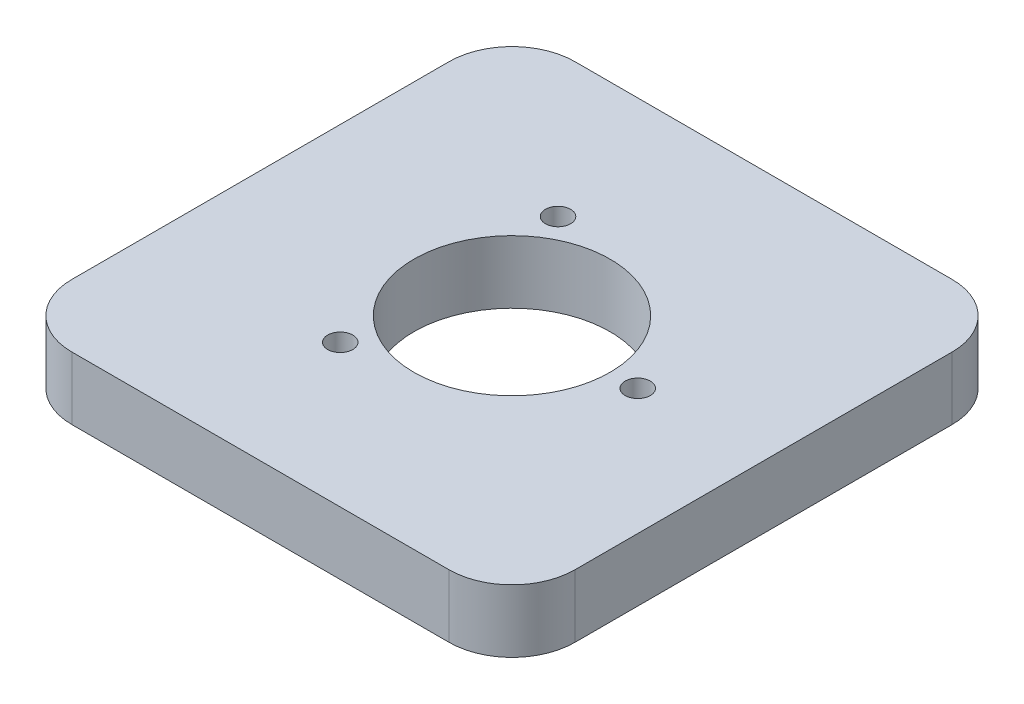
ISO-10303-21;
HEADER;
FILE_DESCRIPTION(('STEP AP214'),'2;1');
FILE_NAME('part.step','',(''),(''),'','','');
FILE_SCHEMA(('AUTOMOTIVE_DESIGN { 1 0 10303 214 1 1 1 1 }'));
ENDSEC;
DATA;
#1=APPLICATION_CONTEXT('core data for automotive mechanical design processes');
#2=APPLICATION_PROTOCOL_DEFINITION('international standard','automotive_design',2000,#1);
#3=PRODUCT_CONTEXT('',#1,'mechanical');
#4=PRODUCT('Part','Part','',(#3));
#5=PRODUCT_RELATED_PRODUCT_CATEGORY('part','',(#4));
#6=PRODUCT_DEFINITION_FORMATION('','',#4);
#7=PRODUCT_DEFINITION_CONTEXT('part definition',#1,'design');
#8=PRODUCT_DEFINITION('design','',#6,#7);
#9=PRODUCT_DEFINITION_SHAPE('','',#8);
#10=(LENGTH_UNIT() NAMED_UNIT(*) SI_UNIT(.MILLI.,.METRE.));
#11=(NAMED_UNIT(*) PLANE_ANGLE_UNIT() SI_UNIT($,.RADIAN.));
#12=(NAMED_UNIT(*) SI_UNIT($,.STERADIAN.) SOLID_ANGLE_UNIT());
#13=UNCERTAINTY_MEASURE_WITH_UNIT(LENGTH_MEASURE(1.E-05),#10,'distance_accuracy_value','');
#14=(GEOMETRIC_REPRESENTATION_CONTEXT(3) GLOBAL_UNCERTAINTY_ASSIGNED_CONTEXT((#13)) GLOBAL_UNIT_ASSIGNED_CONTEXT((#10,
#11,#12)) REPRESENTATION_CONTEXT('',''));
#15=CARTESIAN_POINT('',(0.,0.,0.));
#16=DIRECTION('',(0.,0.,1.));
#17=DIRECTION('',(1.,0.,0.));
#18=AXIS2_PLACEMENT_3D('',#15,#16,#17);
#19=CARTESIAN_POINT('',(25.4,6.35,25.4));
#20=DIRECTION('',(-1.,0.,0.));
#21=DIRECTION('',(0.,0.,1.));
#22=AXIS2_PLACEMENT_3D('',#19,#20,#21);
#23=PLANE('',#22);
#24=DIRECTION('',(0.,0.,-1.));
#25=VECTOR('',#24,1.);
#26=CARTESIAN_POINT('',(25.4,6.35,25.4));
#27=LINE('',#26,#25);
#28=CARTESIAN_POINT('',(25.4,6.35,19.05));
#29=VERTEX_POINT('',#28);
#30=CARTESIAN_POINT('',(25.4,6.35,-19.05));
#31=VERTEX_POINT('',#30);
#32=EDGE_CURVE('E121',#29,#31,#27,.T.);
#33=ORIENTED_EDGE('',*,*,#32,.F.);
#34=DIRECTION('',(0.,-1.,0.));
#35=VECTOR('',#34,1.);
#36=CARTESIAN_POINT('',(25.4,6.35,19.05));
#37=LINE('',#36,#35);
#38=CARTESIAN_POINT('',(25.4,0.,19.05));
#39=VERTEX_POINT('',#38);
#40=EDGE_CURVE('E106',#29,#39,#37,.T.);
#41=ORIENTED_EDGE('',*,*,#40,.T.);
#42=DIRECTION('',(0.,0.,-1.));
#43=VECTOR('',#42,1.);
#44=CARTESIAN_POINT('',(25.4,0.,25.4));
#45=LINE('',#44,#43);
#46=CARTESIAN_POINT('',(25.4,0.,-19.05));
#47=VERTEX_POINT('',#46);
#48=EDGE_CURVE('E118',#39,#47,#45,.T.);
#49=ORIENTED_EDGE('',*,*,#48,.T.);
#50=DIRECTION('',(0.,-1.,0.));
#51=VECTOR('',#50,1.);
#52=CARTESIAN_POINT('',(25.4,6.35,-19.05));
#53=LINE('',#52,#51);
#54=EDGE_CURVE('E123',#47,#31,#53,.F.);
#55=ORIENTED_EDGE('',*,*,#54,.T.);
#56=EDGE_LOOP('',(#33,#41,#49,#55));
#57=FACE_BOUND('',#56,.T.);
#58=ADVANCED_FACE('F35',(#57),#23,.F.);
#59=CARTESIAN_POINT('',(-25.4,6.35,-25.4));
#60=DIRECTION('',(0.,0.,1.));
#61=DIRECTION('',(1.,0.,0.));
#62=AXIS2_PLACEMENT_3D('',#59,#60,#61);
#63=PLANE('',#62);
#64=DIRECTION('',(-1.,0.,0.));
#65=VECTOR('',#64,1.);
#66=CARTESIAN_POINT('',(-25.4,6.35,-25.4));
#67=LINE('',#66,#65);
#68=CARTESIAN_POINT('',(19.05,6.35,-25.4));
#69=VERTEX_POINT('',#68);
#70=CARTESIAN_POINT('',(-19.05,6.35,-25.4));
#71=VERTEX_POINT('',#70);
#72=EDGE_CURVE('E165',#69,#71,#67,.T.);
#73=ORIENTED_EDGE('',*,*,#72,.F.);
#74=DIRECTION('',(0.,-1.,0.));
#75=VECTOR('',#74,1.);
#76=CARTESIAN_POINT('',(19.05,6.35,-25.4));
#77=LINE('',#76,#75);
#78=CARTESIAN_POINT('',(19.05,0.,-25.4));
#79=VERTEX_POINT('',#78);
#80=EDGE_CURVE('E11',#69,#79,#77,.T.);
#81=ORIENTED_EDGE('',*,*,#80,.T.);
#82=DIRECTION('',(-1.,0.,0.));
#83=VECTOR('',#82,1.);
#84=CARTESIAN_POINT('',(-25.4,0.,-25.4));
#85=LINE('',#84,#83);
#86=CARTESIAN_POINT('',(-19.05,0.,-25.4));
#87=VERTEX_POINT('',#86);
#88=EDGE_CURVE('E128',#79,#87,#85,.T.);
#89=ORIENTED_EDGE('',*,*,#88,.T.);
#90=DIRECTION('',(0.,-1.,0.));
#91=VECTOR('',#90,1.);
#92=CARTESIAN_POINT('',(-19.05,6.35,-25.4));
#93=LINE('',#92,#91);
#94=EDGE_CURVE('E43',#87,#71,#93,.F.);
#95=ORIENTED_EDGE('',*,*,#94,.T.);
#96=EDGE_LOOP('',(#73,#81,#89,#95));
#97=FACE_BOUND('',#96,.T.);
#98=ADVANCED_FACE('F164',(#97),#63,.F.);
#99=CARTESIAN_POINT('',(-25.4,6.35,25.4));
#100=DIRECTION('',(1.,0.,0.));
#101=DIRECTION('',(0.,0.,-1.));
#102=AXIS2_PLACEMENT_3D('',#99,#100,#101);
#103=PLANE('',#102);
#104=DIRECTION('',(0.,0.,1.));
#105=VECTOR('',#104,1.);
#106=CARTESIAN_POINT('',(-25.4,0.,25.4));
#107=LINE('',#106,#105);
#108=CARTESIAN_POINT('',(-25.4,0.,-19.05));
#109=VERTEX_POINT('',#108);
#110=CARTESIAN_POINT('',(-25.4,0.,19.05));
#111=VERTEX_POINT('',#110);
#112=EDGE_CURVE('E132',#109,#111,#107,.T.);
#113=ORIENTED_EDGE('',*,*,#112,.T.);
#114=DIRECTION('',(0.,-1.,0.));
#115=VECTOR('',#114,1.);
#116=CARTESIAN_POINT('',(-25.4,6.35,19.05));
#117=LINE('',#116,#115);
#118=CARTESIAN_POINT('',(-25.4,6.35,19.05));
#119=VERTEX_POINT('',#118);
#120=EDGE_CURVE('E50',#111,#119,#117,.F.);
#121=ORIENTED_EDGE('',*,*,#120,.T.);
#122=DIRECTION('',(0.,0.,1.));
#123=VECTOR('',#122,1.);
#124=CARTESIAN_POINT('',(-25.4,6.35,25.4));
#125=LINE('',#124,#123);
#126=CARTESIAN_POINT('',(-25.4,6.35,-19.05));
#127=VERTEX_POINT('',#126);
#128=EDGE_CURVE('E171',#127,#119,#125,.T.);
#129=ORIENTED_EDGE('',*,*,#128,.F.);
#130=DIRECTION('',(0.,-1.,0.));
#131=VECTOR('',#130,1.);
#132=CARTESIAN_POINT('',(-25.4,6.35,-19.05));
#133=LINE('',#132,#131);
#134=EDGE_CURVE('E158',#127,#109,#133,.T.);
#135=ORIENTED_EDGE('',*,*,#134,.T.);
#136=EDGE_LOOP('',(#113,#121,#129,#135));
#137=FACE_BOUND('',#136,.T.);
#138=ADVANCED_FACE('F175',(#137),#103,.F.);
#139=CARTESIAN_POINT('',(-25.4,6.35,25.4));
#140=DIRECTION('',(0.,0.,-1.));
#141=DIRECTION('',(-1.,0.,0.));
#142=AXIS2_PLACEMENT_3D('',#139,#140,#141);
#143=PLANE('',#142);
#144=DIRECTION('',(1.,0.,0.));
#145=VECTOR('',#144,1.);
#146=CARTESIAN_POINT('',(-25.4,0.,25.4));
#147=LINE('',#146,#145);
#148=CARTESIAN_POINT('',(-19.05,0.,25.4));
#149=VERTEX_POINT('',#148);
#150=CARTESIAN_POINT('',(19.05,0.,25.4));
#151=VERTEX_POINT('',#150);
#152=EDGE_CURVE('E142',#149,#151,#147,.T.);
#153=ORIENTED_EDGE('',*,*,#152,.T.);
#154=DIRECTION('',(0.,-1.,0.));
#155=VECTOR('',#154,1.);
#156=CARTESIAN_POINT('',(19.05,6.35,25.4));
#157=LINE('',#156,#155);
#158=CARTESIAN_POINT('',(19.05,6.35,25.4));
#159=VERTEX_POINT('',#158);
#160=EDGE_CURVE('E107',#151,#159,#157,.F.);
#161=ORIENTED_EDGE('',*,*,#160,.T.);
#162=DIRECTION('',(1.,0.,0.));
#163=VECTOR('',#162,1.);
#164=CARTESIAN_POINT('',(-25.4,6.35,25.4));
#165=LINE('',#164,#163);
#166=CARTESIAN_POINT('',(-19.05,6.35,25.4));
#167=VERTEX_POINT('',#166);
#168=EDGE_CURVE('E138',#167,#159,#165,.T.);
#169=ORIENTED_EDGE('',*,*,#168,.F.);
#170=DIRECTION('',(0.,-1.,0.));
#171=VECTOR('',#170,1.);
#172=CARTESIAN_POINT('',(-19.05,6.35,25.4));
#173=LINE('',#172,#171);
#174=EDGE_CURVE('E112',#167,#149,#173,.T.);
#175=ORIENTED_EDGE('',*,*,#174,.T.);
#176=EDGE_LOOP('',(#153,#161,#169,#175));
#177=FACE_BOUND('',#176,.T.);
#178=ADVANCED_FACE('F182',(#177),#143,.F.);
#179=CARTESIAN_POINT('',(0.,6.35,0.));
#180=DIRECTION('',(0.,-1.,0.));
#181=DIRECTION('',(0.,0.,-1.));
#182=AXIS2_PLACEMENT_3D('',#179,#180,#181);
#183=PLANE('',#182);
#184=CARTESIAN_POINT('',(-6.3499999999999,6.35,10.9985226280624));
#185=DIRECTION('',(0.,1.,0.));
#186=DIRECTION('',(-0.866025403784443,0.,-0.499999999999992));
#187=AXIS2_PLACEMENT_3D('',#184,#185,#186);
#188=CIRCLE('',#187,1.27);
#189=CARTESIAN_POINT('',(-7.44985226280614,6.35,10.3635226280624));
#190=VERTEX_POINT('',#189);
#191=EDGE_CURVE('E200',#190,#190,#188,.T.);
#192=ORIENTED_EDGE('',*,*,#191,.F.);
#193=EDGE_LOOP('',(#192));
#194=FACE_BOUND('',#193,.T.);
#195=CARTESIAN_POINT('',(-6.35000000000005,6.35,-10.9985226280623));
#196=DIRECTION('',(0.,1.,0.));
#197=DIRECTION('',(0.866025403784436,0.,-0.500000000000004));
#198=AXIS2_PLACEMENT_3D('',#195,#196,#197);
#199=CIRCLE('',#198,1.27);
#200=CARTESIAN_POINT('',(-5.25014773719382,6.35,-11.6335226280623));
#201=VERTEX_POINT('',#200);
#202=EDGE_CURVE('E194',#201,#201,#199,.T.);
#203=ORIENTED_EDGE('',*,*,#202,.F.);
#204=EDGE_LOOP('',(#203));
#205=FACE_BOUND('',#204,.T.);
#206=CARTESIAN_POINT('',(12.7,6.35,0.));
#207=DIRECTION('',(0.,1.,0.));
#208=DIRECTION('',(0.,0.,1.));
#209=AXIS2_PLACEMENT_3D('',#206,#207,#208);
#210=CIRCLE('',#209,1.27);
#211=CARTESIAN_POINT('',(12.7,6.35,1.27));
#212=VERTEX_POINT('',#211);
#213=EDGE_CURVE('E188',#212,#212,#210,.T.);
#214=ORIENTED_EDGE('',*,*,#213,.F.);
#215=EDGE_LOOP('',(#214));
#216=FACE_BOUND('',#215,.T.);
#217=CARTESIAN_POINT('',(0.,6.35,0.));
#218=DIRECTION('',(0.,1.,0.));
#219=DIRECTION('',(0.,0.,1.));
#220=AXIS2_PLACEMENT_3D('',#217,#218,#219);
#221=CIRCLE('',#220,9.906);
#222=CARTESIAN_POINT('',(0.,6.35,9.906));
#223=VERTEX_POINT('',#222);
#224=EDGE_CURVE('E135',#223,#223,#221,.T.);
#225=ORIENTED_EDGE('',*,*,#224,.F.);
#226=EDGE_LOOP('',(#225));
#227=FACE_BOUND('',#226,.T.);
#228=ORIENTED_EDGE('',*,*,#168,.T.);
#229=CARTESIAN_POINT('',(19.05,6.35,19.05));
#230=DIRECTION('',(0.,-1.,0.));
#231=DIRECTION('',(0.,0.,-1.));
#232=AXIS2_PLACEMENT_3D('',#229,#230,#231);
#233=CIRCLE('',#232,6.35);
#234=EDGE_CURVE('E156',#159,#29,#233,.F.);
#235=ORIENTED_EDGE('',*,*,#234,.T.);
#236=ORIENTED_EDGE('',*,*,#32,.T.);
#237=CARTESIAN_POINT('',(19.05,6.35,-19.05));
#238=DIRECTION('',(0.,-1.,0.));
#239=DIRECTION('',(0.,0.,-1.));
#240=AXIS2_PLACEMENT_3D('',#237,#238,#239);
#241=CIRCLE('',#240,6.35);
#242=EDGE_CURVE('E152',#31,#69,#241,.F.);
#243=ORIENTED_EDGE('',*,*,#242,.T.);
#244=ORIENTED_EDGE('',*,*,#72,.T.);
#245=CARTESIAN_POINT('',(-19.05,6.35,-19.05));
#246=DIRECTION('',(0.,-1.,0.));
#247=DIRECTION('',(0.,0.,-1.));
#248=AXIS2_PLACEMENT_3D('',#245,#246,#247);
#249=CIRCLE('',#248,6.35);
#250=EDGE_CURVE('E57',#71,#127,#249,.F.);
#251=ORIENTED_EDGE('',*,*,#250,.T.);
#252=ORIENTED_EDGE('',*,*,#128,.T.);
#253=CARTESIAN_POINT('',(-19.05,6.35,19.05));
#254=DIRECTION('',(0.,-1.,0.));
#255=DIRECTION('',(0.,0.,-1.));
#256=AXIS2_PLACEMENT_3D('',#253,#254,#255);
#257=CIRCLE('',#256,6.35);
#258=EDGE_CURVE('E154',#119,#167,#257,.F.);
#259=ORIENTED_EDGE('',*,*,#258,.T.);
#260=EDGE_LOOP('',(#228,#235,#236,#243,#244,#251,#252,#259));
#261=FACE_BOUND('',#260,.T.);
#262=ADVANCED_FACE('F169',(#194,#205,#216,#227,#261),#183,.F.);
#263=CARTESIAN_POINT('',(0.,0.,0.));
#264=DIRECTION('',(0.,-1.,0.));
#265=DIRECTION('',(0.,0.,-1.));
#266=AXIS2_PLACEMENT_3D('',#263,#264,#265);
#267=PLANE('',#266);
#268=CARTESIAN_POINT('',(-6.3499999999999,0.,10.9985226280624));
#269=DIRECTION('',(0.,1.,0.));
#270=DIRECTION('',(-0.866025403784443,0.,-0.499999999999992));
#271=AXIS2_PLACEMENT_3D('',#268,#269,#270);
#272=CIRCLE('',#271,1.27);
#273=CARTESIAN_POINT('',(-7.44985226280614,0.,10.3635226280624));
#274=VERTEX_POINT('',#273);
#275=EDGE_CURVE('E197',#274,#274,#272,.T.);
#276=ORIENTED_EDGE('',*,*,#275,.T.);
#277=EDGE_LOOP('',(#276));
#278=FACE_BOUND('',#277,.T.);
#279=CARTESIAN_POINT('',(-6.35000000000005,0.,-10.9985226280623));
#280=DIRECTION('',(0.,1.,0.));
#281=DIRECTION('',(0.866025403784436,0.,-0.500000000000004));
#282=AXIS2_PLACEMENT_3D('',#279,#280,#281);
#283=CIRCLE('',#282,1.27);
#284=CARTESIAN_POINT('',(-5.25014773719382,0.,-11.6335226280623));
#285=VERTEX_POINT('',#284);
#286=EDGE_CURVE('E191',#285,#285,#283,.T.);
#287=ORIENTED_EDGE('',*,*,#286,.T.);
#288=EDGE_LOOP('',(#287));
#289=FACE_BOUND('',#288,.T.);
#290=CARTESIAN_POINT('',(12.7,0.,0.));
#291=DIRECTION('',(0.,1.,0.));
#292=DIRECTION('',(0.,0.,1.));
#293=AXIS2_PLACEMENT_3D('',#290,#291,#292);
#294=CIRCLE('',#293,1.27);
#295=CARTESIAN_POINT('',(12.7,0.,1.27));
#296=VERTEX_POINT('',#295);
#297=EDGE_CURVE('E186',#296,#296,#294,.T.);
#298=ORIENTED_EDGE('',*,*,#297,.T.);
#299=EDGE_LOOP('',(#298));
#300=FACE_BOUND('',#299,.T.);
#301=CARTESIAN_POINT('',(0.,0.,0.));
#302=DIRECTION('',(0.,1.,0.));
#303=DIRECTION('',(0.,0.,1.));
#304=AXIS2_PLACEMENT_3D('',#301,#302,#303);
#305=CIRCLE('',#304,9.906);
#306=CARTESIAN_POINT('',(0.,0.,9.906));
#307=VERTEX_POINT('',#306);
#308=EDGE_CURVE('E129',#307,#307,#305,.T.);
#309=ORIENTED_EDGE('',*,*,#308,.T.);
#310=EDGE_LOOP('',(#309));
#311=FACE_BOUND('',#310,.T.);
#312=ORIENTED_EDGE('',*,*,#48,.F.);
#313=CARTESIAN_POINT('',(19.05,0.,19.05));
#314=DIRECTION('',(0.,-1.,0.));
#315=DIRECTION('',(0.,0.,-1.));
#316=AXIS2_PLACEMENT_3D('',#313,#314,#315);
#317=CIRCLE('',#316,6.35);
#318=EDGE_CURVE('E102',#39,#151,#317,.T.);
#319=ORIENTED_EDGE('',*,*,#318,.T.);
#320=ORIENTED_EDGE('',*,*,#152,.F.);
#321=CARTESIAN_POINT('',(-19.05,0.,19.05));
#322=DIRECTION('',(0.,-1.,0.));
#323=DIRECTION('',(0.,0.,-1.));
#324=AXIS2_PLACEMENT_3D('',#321,#322,#323);
#325=CIRCLE('',#324,6.35);
#326=EDGE_CURVE('E113',#149,#111,#325,.T.);
#327=ORIENTED_EDGE('',*,*,#326,.T.);
#328=ORIENTED_EDGE('',*,*,#112,.F.);
#329=CARTESIAN_POINT('',(-19.05,0.,-19.05));
#330=DIRECTION('',(0.,-1.,0.));
#331=DIRECTION('',(0.,0.,-1.));
#332=AXIS2_PLACEMENT_3D('',#329,#330,#331);
#333=CIRCLE('',#332,6.35);
#334=EDGE_CURVE('E122',#109,#87,#333,.T.);
#335=ORIENTED_EDGE('',*,*,#334,.T.);
#336=ORIENTED_EDGE('',*,*,#88,.F.);
#337=CARTESIAN_POINT('',(19.05,0.,-19.05));
#338=DIRECTION('',(0.,-1.,0.));
#339=DIRECTION('',(0.,0.,-1.));
#340=AXIS2_PLACEMENT_3D('',#337,#338,#339);
#341=CIRCLE('',#340,6.35);
#342=EDGE_CURVE('E127',#79,#47,#341,.T.);
#343=ORIENTED_EDGE('',*,*,#342,.T.);
#344=EDGE_LOOP('',(#312,#319,#320,#327,#328,#335,#336,#343));
#345=FACE_BOUND('',#344,.T.);
#346=ADVANCED_FACE('F125',(#278,#289,#300,#311,#345),#267,.T.);
#347=CARTESIAN_POINT('',(0.,0.,0.));
#348=DIRECTION('',(0.,1.,0.));
#349=DIRECTION('',(0.,0.,1.));
#350=AXIS2_PLACEMENT_3D('',#347,#348,#349);
#351=CYLINDRICAL_SURFACE('',#350,9.906);
#352=ORIENTED_EDGE('',*,*,#308,.F.);
#353=EDGE_LOOP('',(#352));
#354=FACE_BOUND('',#353,.T.);
#355=ORIENTED_EDGE('',*,*,#224,.T.);
#356=EDGE_LOOP('',(#355));
#357=FACE_BOUND('',#356,.T.);
#358=ADVANCED_FACE('F224',(#354,#357),#351,.F.);
#359=CARTESIAN_POINT('',(12.7,0.,0.));
#360=DIRECTION('',(0.,1.,0.));
#361=DIRECTION('',(0.,0.,1.));
#362=AXIS2_PLACEMENT_3D('',#359,#360,#361);
#363=CYLINDRICAL_SURFACE('',#362,1.27);
#364=ORIENTED_EDGE('',*,*,#297,.F.);
#365=EDGE_LOOP('',(#364));
#366=FACE_BOUND('',#365,.T.);
#367=ORIENTED_EDGE('',*,*,#213,.T.);
#368=EDGE_LOOP('',(#367));
#369=FACE_BOUND('',#368,.T.);
#370=ADVANCED_FACE('F226',(#366,#369),#363,.F.);
#371=CARTESIAN_POINT('',(-6.35000000000005,0.,-10.9985226280623));
#372=DIRECTION('',(0.,1.,0.));
#373=DIRECTION('',(0.,0.,1.));
#374=AXIS2_PLACEMENT_3D('',#371,#372,#373);
#375=CYLINDRICAL_SURFACE('',#374,1.27);
#376=ORIENTED_EDGE('',*,*,#286,.F.);
#377=EDGE_LOOP('',(#376));
#378=FACE_BOUND('',#377,.T.);
#379=ORIENTED_EDGE('',*,*,#202,.T.);
#380=EDGE_LOOP('',(#379));
#381=FACE_BOUND('',#380,.T.);
#382=ADVANCED_FACE('F211',(#378,#381),#375,.F.);
#383=CARTESIAN_POINT('',(-6.3499999999999,0.,10.9985226280624));
#384=DIRECTION('',(0.,1.,0.));
#385=DIRECTION('',(0.,0.,1.));
#386=AXIS2_PLACEMENT_3D('',#383,#384,#385);
#387=CYLINDRICAL_SURFACE('',#386,1.27);
#388=ORIENTED_EDGE('',*,*,#275,.F.);
#389=EDGE_LOOP('',(#388));
#390=FACE_BOUND('',#389,.T.);
#391=ORIENTED_EDGE('',*,*,#191,.T.);
#392=EDGE_LOOP('',(#391));
#393=FACE_BOUND('',#392,.T.);
#394=ADVANCED_FACE('F208',(#390,#393),#387,.F.);
#395=CARTESIAN_POINT('',(19.05,6.35,19.05));
#396=DIRECTION('',(0.,-1.,0.));
#397=DIRECTION('',(0.,0.,-1.));
#398=AXIS2_PLACEMENT_3D('',#395,#396,#397);
#399=CYLINDRICAL_SURFACE('',#398,6.35);
#400=ORIENTED_EDGE('',*,*,#234,.F.);
#401=ORIENTED_EDGE('',*,*,#160,.F.);
#402=ORIENTED_EDGE('',*,*,#318,.F.);
#403=ORIENTED_EDGE('',*,*,#40,.F.);
#404=EDGE_LOOP('',(#400,#401,#402,#403));
#405=FACE_BOUND('',#404,.T.);
#406=ADVANCED_FACE('F105',(#405),#399,.T.);
#407=CARTESIAN_POINT('',(-19.05,6.35,19.05));
#408=DIRECTION('',(0.,-1.,0.));
#409=DIRECTION('',(0.,0.,-1.));
#410=AXIS2_PLACEMENT_3D('',#407,#408,#409);
#411=CYLINDRICAL_SURFACE('',#410,6.35);
#412=ORIENTED_EDGE('',*,*,#258,.F.);
#413=ORIENTED_EDGE('',*,*,#120,.F.);
#414=ORIENTED_EDGE('',*,*,#326,.F.);
#415=ORIENTED_EDGE('',*,*,#174,.F.);
#416=EDGE_LOOP('',(#412,#413,#414,#415));
#417=FACE_BOUND('',#416,.T.);
#418=ADVANCED_FACE('F179',(#417),#411,.T.);
#419=CARTESIAN_POINT('',(19.05,6.35,-19.05));
#420=DIRECTION('',(0.,-1.,0.));
#421=DIRECTION('',(0.,0.,-1.));
#422=AXIS2_PLACEMENT_3D('',#419,#420,#421);
#423=CYLINDRICAL_SURFACE('',#422,6.35);
#424=ORIENTED_EDGE('',*,*,#242,.F.);
#425=ORIENTED_EDGE('',*,*,#54,.F.);
#426=ORIENTED_EDGE('',*,*,#342,.F.);
#427=ORIENTED_EDGE('',*,*,#80,.F.);
#428=EDGE_LOOP('',(#424,#425,#426,#427));
#429=FACE_BOUND('',#428,.T.);
#430=ADVANCED_FACE('F248',(#429),#423,.T.);
#431=CARTESIAN_POINT('',(-19.05,6.35,-19.05));
#432=DIRECTION('',(0.,-1.,0.));
#433=DIRECTION('',(0.,0.,-1.));
#434=AXIS2_PLACEMENT_3D('',#431,#432,#433);
#435=CYLINDRICAL_SURFACE('',#434,6.35);
#436=ORIENTED_EDGE('',*,*,#250,.F.);
#437=ORIENTED_EDGE('',*,*,#94,.F.);
#438=ORIENTED_EDGE('',*,*,#334,.F.);
#439=ORIENTED_EDGE('',*,*,#134,.F.);
#440=EDGE_LOOP('',(#436,#437,#438,#439));
#441=FACE_BOUND('',#440,.T.);
#442=ADVANCED_FACE('F37',(#441),#435,.T.);
#443=CLOSED_SHELL('',(#58,#98,#138,#178,#262,#346,#358,#370,#382,#394,#406,#418,#430,#442));
#444=MANIFOLD_SOLID_BREP('B2',#443);
#445=ADVANCED_BREP_SHAPE_REPRESENTATION('',(#18,#444),#14);
#446=SHAPE_DEFINITION_REPRESENTATION(#9,#445);
ENDSEC;
END-ISO-10303-21;
